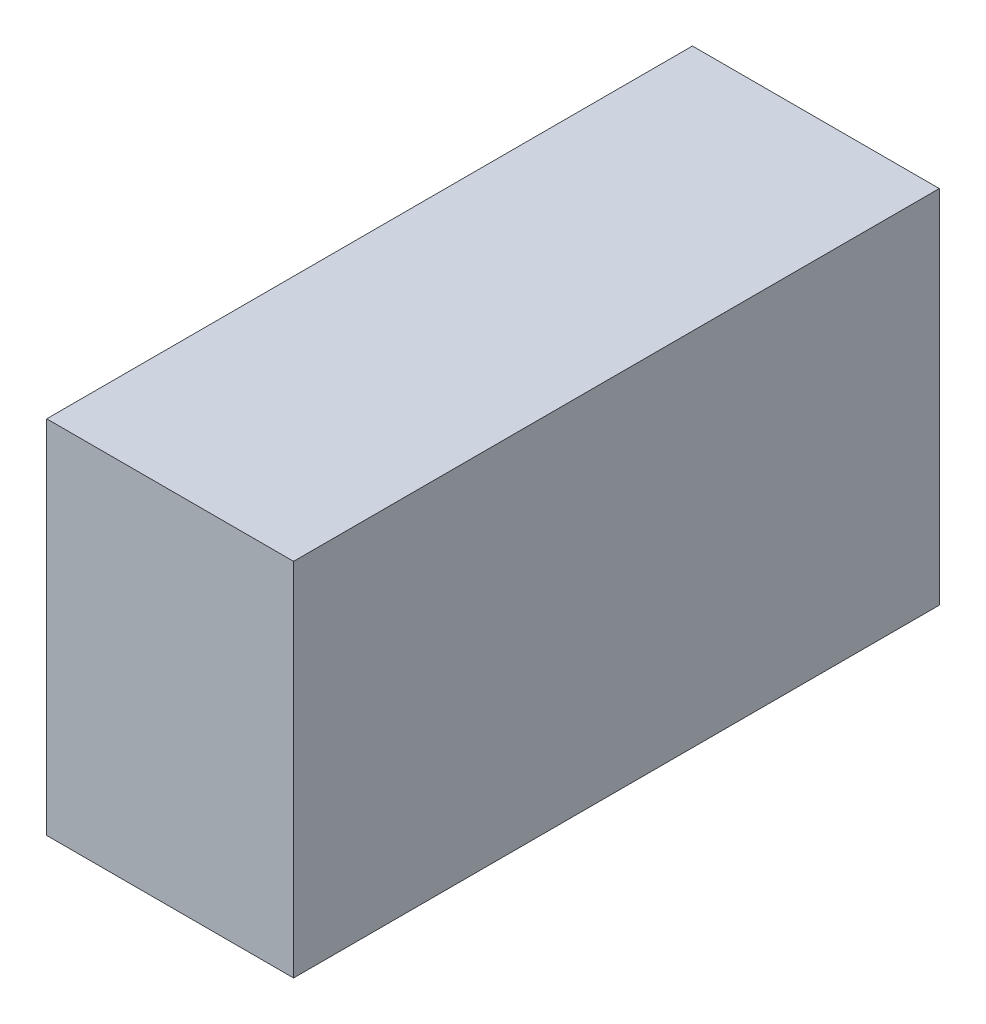
ISO-10303-21;
HEADER;
FILE_DESCRIPTION(('STEP AP214'),'2;1');
FILE_NAME('part.step','',(''),(''),'','','');
FILE_SCHEMA(('AUTOMOTIVE_DESIGN { 1 0 10303 214 1 1 1 1 }'));
ENDSEC;
DATA;
#1=APPLICATION_CONTEXT('core data for automotive mechanical design processes');
#2=APPLICATION_PROTOCOL_DEFINITION('international standard','automotive_design',2000,#1);
#3=PRODUCT_CONTEXT('',#1,'mechanical');
#4=PRODUCT('Part','Part','',(#3));
#5=PRODUCT_RELATED_PRODUCT_CATEGORY('part','',(#4));
#6=PRODUCT_DEFINITION_FORMATION('','',#4);
#7=PRODUCT_DEFINITION_CONTEXT('part definition',#1,'design');
#8=PRODUCT_DEFINITION('design','',#6,#7);
#9=PRODUCT_DEFINITION_SHAPE('','',#8);
#10=(LENGTH_UNIT() NAMED_UNIT(*) SI_UNIT(.MILLI.,.METRE.));
#11=(NAMED_UNIT(*) PLANE_ANGLE_UNIT() SI_UNIT($,.RADIAN.));
#12=(NAMED_UNIT(*) SI_UNIT($,.STERADIAN.) SOLID_ANGLE_UNIT());
#13=UNCERTAINTY_MEASURE_WITH_UNIT(LENGTH_MEASURE(1.E-05),#10,'distance_accuracy_value','');
#14=(GEOMETRIC_REPRESENTATION_CONTEXT(3) GLOBAL_UNCERTAINTY_ASSIGNED_CONTEXT((#13)) GLOBAL_UNIT_ASSIGNED_CONTEXT((#10,
#11,#12)) REPRESENTATION_CONTEXT('',''));
#15=CARTESIAN_POINT('',(0.,0.,0.));
#16=DIRECTION('',(0.,0.,1.));
#17=DIRECTION('',(1.,0.,0.));
#18=AXIS2_PLACEMENT_3D('',#15,#16,#17);
#19=CARTESIAN_POINT('',(65.,190.,170.));
#20=DIRECTION('',(-1.,0.,0.));
#21=DIRECTION('',(0.,0.,1.));
#22=AXIS2_PLACEMENT_3D('',#19,#20,#21);
#23=PLANE('',#22);
#24=DIRECTION('',(0.,0.,-1.));
#25=VECTOR('',#24,1.);
#26=CARTESIAN_POINT('',(65.,0.,170.));
#27=LINE('',#26,#25);
#28=CARTESIAN_POINT('',(65.,0.,170.));
#29=VERTEX_POINT('',#28);
#30=CARTESIAN_POINT('',(65.,0.,-170.));
#31=VERTEX_POINT('',#30);
#32=EDGE_CURVE('E100',#29,#31,#27,.T.);
#33=ORIENTED_EDGE('',*,*,#32,.T.);
#34=DIRECTION('',(0.,-1.,0.));
#35=VECTOR('',#34,1.);
#36=CARTESIAN_POINT('',(65.,190.,-170.));
#37=LINE('',#36,#35);
#38=CARTESIAN_POINT('',(65.,190.,-170.));
#39=VERTEX_POINT('',#38);
#40=EDGE_CURVE('E11',#39,#31,#37,.T.);
#41=ORIENTED_EDGE('',*,*,#40,.F.);
#42=DIRECTION('',(0.,0.,-1.));
#43=VECTOR('',#42,1.);
#44=CARTESIAN_POINT('',(65.,190.,170.));
#45=LINE('',#44,#43);
#46=CARTESIAN_POINT('',(65.,190.,170.));
#47=VERTEX_POINT('',#46);
#48=EDGE_CURVE('E88',#47,#39,#45,.T.);
#49=ORIENTED_EDGE('',*,*,#48,.F.);
#50=DIRECTION('',(0.,-1.,0.));
#51=VECTOR('',#50,1.);
#52=CARTESIAN_POINT('',(65.,190.,170.));
#53=LINE('',#52,#51);
#54=EDGE_CURVE('E96',#47,#29,#53,.T.);
#55=ORIENTED_EDGE('',*,*,#54,.T.);
#56=EDGE_LOOP('',(#33,#41,#49,#55));
#57=FACE_BOUND('',#56,.T.);
#58=ADVANCED_FACE('F37',(#57),#23,.F.);
#59=CARTESIAN_POINT('',(-65.,190.,-170.));
#60=DIRECTION('',(0.,0.,1.));
#61=DIRECTION('',(1.,0.,0.));
#62=AXIS2_PLACEMENT_3D('',#59,#60,#61);
#63=PLANE('',#62);
#64=DIRECTION('',(-1.,0.,0.));
#65=VECTOR('',#64,1.);
#66=CARTESIAN_POINT('',(-65.,0.,-170.));
#67=LINE('',#66,#65);
#68=CARTESIAN_POINT('',(-65.,0.,-170.));
#69=VERTEX_POINT('',#68);
#70=EDGE_CURVE('E92',#31,#69,#67,.T.);
#71=ORIENTED_EDGE('',*,*,#70,.T.);
#72=DIRECTION('',(0.,-1.,0.));
#73=VECTOR('',#72,1.);
#74=CARTESIAN_POINT('',(-65.,190.,-170.));
#75=LINE('',#74,#73);
#76=CARTESIAN_POINT('',(-65.,190.,-170.));
#77=VERTEX_POINT('',#76);
#78=EDGE_CURVE('E45',#77,#69,#75,.T.);
#79=ORIENTED_EDGE('',*,*,#78,.F.);
#80=DIRECTION('',(-1.,0.,0.));
#81=VECTOR('',#80,1.);
#82=CARTESIAN_POINT('',(-65.,190.,-170.));
#83=LINE('',#82,#81);
#84=EDGE_CURVE('E83',#39,#77,#83,.T.);
#85=ORIENTED_EDGE('',*,*,#84,.F.);
#86=ORIENTED_EDGE('',*,*,#40,.T.);
#87=EDGE_LOOP('',(#71,#79,#85,#86));
#88=FACE_BOUND('',#87,.T.);
#89=ADVANCED_FACE('F91',(#88),#63,.F.);
#90=CARTESIAN_POINT('',(-65.,190.,170.));
#91=DIRECTION('',(1.,0.,0.));
#92=DIRECTION('',(0.,0.,-1.));
#93=AXIS2_PLACEMENT_3D('',#90,#91,#92);
#94=PLANE('',#93);
#95=DIRECTION('',(0.,0.,1.));
#96=VECTOR('',#95,1.);
#97=CARTESIAN_POINT('',(-65.,0.,170.));
#98=LINE('',#97,#96);
#99=CARTESIAN_POINT('',(-65.,0.,170.));
#100=VERTEX_POINT('',#99);
#101=EDGE_CURVE('E70',#69,#100,#98,.T.);
#102=ORIENTED_EDGE('',*,*,#101,.T.);
#103=DIRECTION('',(0.,-1.,0.));
#104=VECTOR('',#103,1.);
#105=CARTESIAN_POINT('',(-65.,190.,170.));
#106=LINE('',#105,#104);
#107=CARTESIAN_POINT('',(-65.,190.,170.));
#108=VERTEX_POINT('',#107);
#109=EDGE_CURVE('E93',#108,#100,#106,.T.);
#110=ORIENTED_EDGE('',*,*,#109,.F.);
#111=DIRECTION('',(0.,0.,1.));
#112=VECTOR('',#111,1.);
#113=CARTESIAN_POINT('',(-65.,190.,170.));
#114=LINE('',#113,#112);
#115=EDGE_CURVE('E86',#77,#108,#114,.T.);
#116=ORIENTED_EDGE('',*,*,#115,.F.);
#117=ORIENTED_EDGE('',*,*,#78,.T.);
#118=EDGE_LOOP('',(#102,#110,#116,#117));
#119=FACE_BOUND('',#118,.T.);
#120=ADVANCED_FACE('F94',(#119),#94,.F.);
#121=CARTESIAN_POINT('',(-65.,190.,170.));
#122=DIRECTION('',(0.,0.,-1.));
#123=DIRECTION('',(-1.,0.,0.));
#124=AXIS2_PLACEMENT_3D('',#121,#122,#123);
#125=PLANE('',#124);
#126=DIRECTION('',(1.,0.,0.));
#127=VECTOR('',#126,1.);
#128=CARTESIAN_POINT('',(-65.,0.,170.));
#129=LINE('',#128,#127);
#130=EDGE_CURVE('E76',#100,#29,#129,.T.);
#131=ORIENTED_EDGE('',*,*,#130,.T.);
#132=ORIENTED_EDGE('',*,*,#54,.F.);
#133=DIRECTION('',(1.,0.,0.));
#134=VECTOR('',#133,1.);
#135=CARTESIAN_POINT('',(-65.,190.,170.));
#136=LINE('',#135,#134);
#137=EDGE_CURVE('E53',#108,#47,#136,.T.);
#138=ORIENTED_EDGE('',*,*,#137,.F.);
#139=ORIENTED_EDGE('',*,*,#109,.T.);
#140=EDGE_LOOP('',(#131,#132,#138,#139));
#141=FACE_BOUND('',#140,.T.);
#142=ADVANCED_FACE('F107',(#141),#125,.F.);
#143=CARTESIAN_POINT('',(0.,190.,0.));
#144=DIRECTION('',(0.,-1.,0.));
#145=DIRECTION('',(0.,0.,-1.));
#146=AXIS2_PLACEMENT_3D('',#143,#144,#145);
#147=PLANE('',#146);
#148=ORIENTED_EDGE('',*,*,#48,.T.);
#149=ORIENTED_EDGE('',*,*,#84,.T.);
#150=ORIENTED_EDGE('',*,*,#115,.T.);
#151=ORIENTED_EDGE('',*,*,#137,.T.);
#152=EDGE_LOOP('',(#148,#149,#150,#151));
#153=FACE_BOUND('',#152,.T.);
#154=ADVANCED_FACE('F84',(#153),#147,.F.);
#155=CARTESIAN_POINT('',(0.,0.,0.));
#156=DIRECTION('',(0.,-1.,0.));
#157=DIRECTION('',(0.,0.,-1.));
#158=AXIS2_PLACEMENT_3D('',#155,#156,#157);
#159=PLANE('',#158);
#160=ORIENTED_EDGE('',*,*,#32,.F.);
#161=ORIENTED_EDGE('',*,*,#130,.F.);
#162=ORIENTED_EDGE('',*,*,#101,.F.);
#163=ORIENTED_EDGE('',*,*,#70,.F.);
#164=EDGE_LOOP('',(#160,#161,#162,#163));
#165=FACE_BOUND('',#164,.T.);
#166=ADVANCED_FACE('F110',(#165),#159,.T.);
#167=CLOSED_SHELL('',(#58,#89,#120,#142,#154,#166));
#168=MANIFOLD_SOLID_BREP('B2',#167);
#169=ADVANCED_BREP_SHAPE_REPRESENTATION('',(#18,#168),#14);
#170=SHAPE_DEFINITION_REPRESENTATION(#9,#169);
ENDSEC;
END-ISO-10303-21;
